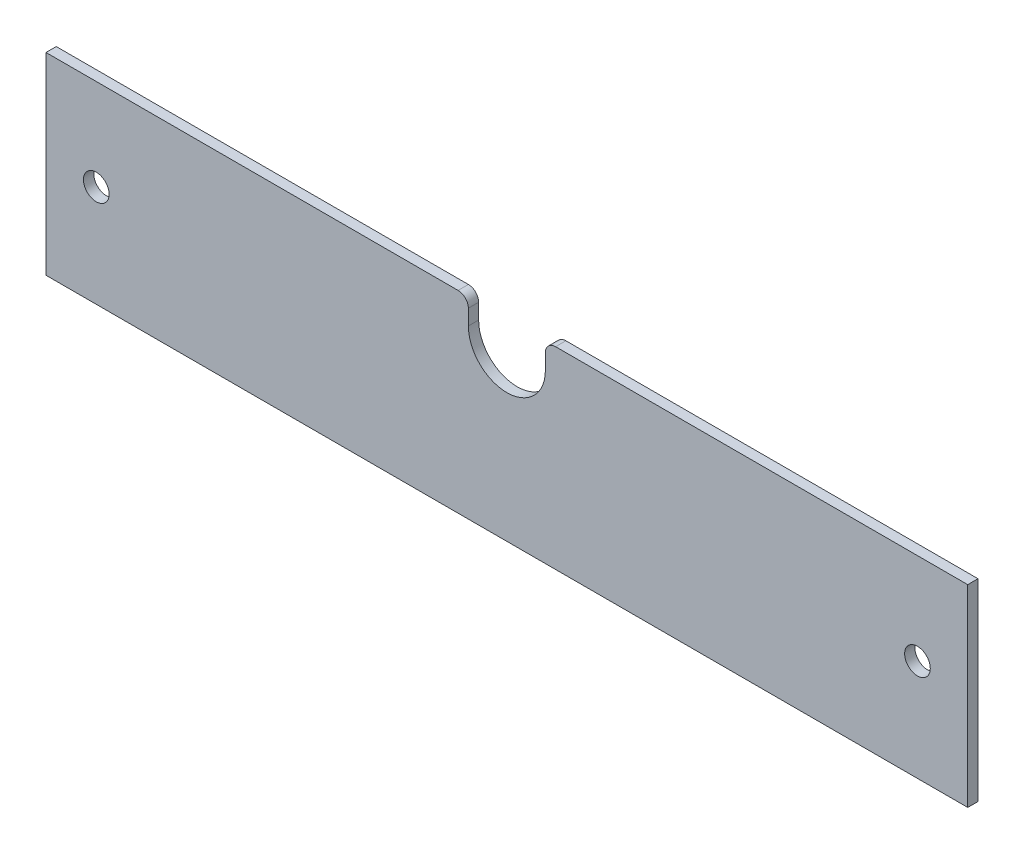
ISO-10303-21;
HEADER;
FILE_DESCRIPTION(('STEP AP214'),'2;1');
FILE_NAME('part.step','',(''),(''),'','','');
FILE_SCHEMA(('AUTOMOTIVE_DESIGN { 1 0 10303 214 1 1 1 1 }'));
ENDSEC;
DATA;
#1=APPLICATION_CONTEXT('core data for automotive mechanical design processes');
#2=APPLICATION_PROTOCOL_DEFINITION('international standard','automotive_design',2000,#1);
#3=PRODUCT_CONTEXT('',#1,'mechanical');
#4=PRODUCT('Part','Part','',(#3));
#5=PRODUCT_RELATED_PRODUCT_CATEGORY('part','',(#4));
#6=PRODUCT_DEFINITION_FORMATION('','',#4);
#7=PRODUCT_DEFINITION_CONTEXT('part definition',#1,'design');
#8=PRODUCT_DEFINITION('design','',#6,#7);
#9=PRODUCT_DEFINITION_SHAPE('','',#8);
#10=(LENGTH_UNIT() NAMED_UNIT(*) SI_UNIT(.MILLI.,.METRE.));
#11=(NAMED_UNIT(*) PLANE_ANGLE_UNIT() SI_UNIT($,.RADIAN.));
#12=(NAMED_UNIT(*) SI_UNIT($,.STERADIAN.) SOLID_ANGLE_UNIT());
#13=UNCERTAINTY_MEASURE_WITH_UNIT(LENGTH_MEASURE(1.E-05),#10,'distance_accuracy_value','');
#14=(GEOMETRIC_REPRESENTATION_CONTEXT(3) GLOBAL_UNCERTAINTY_ASSIGNED_CONTEXT((#13)) GLOBAL_UNIT_ASSIGNED_CONTEXT((#10,
#11,#12)) REPRESENTATION_CONTEXT('',''));
#15=CARTESIAN_POINT('',(0.,0.,0.));
#16=DIRECTION('',(0.,0.,1.));
#17=DIRECTION('',(1.,0.,0.));
#18=AXIS2_PLACEMENT_3D('',#15,#16,#17);
#19=CARTESIAN_POINT('',(0.,13.8,2.));
#20=DIRECTION('',(0.,0.,-1.));
#21=DIRECTION('',(-1.,0.,0.));
#22=AXIS2_PLACEMENT_3D('',#19,#20,#21);
#23=CYLINDRICAL_SURFACE('',#22,7.5);
#24=CARTESIAN_POINT('',(0.,13.8,0.));
#25=DIRECTION('',(0.,0.,1.));
#26=DIRECTION('',(1.,0.,0.));
#27=AXIS2_PLACEMENT_3D('',#24,#25,#26);
#28=CIRCLE('',#27,7.5);
#29=CARTESIAN_POINT('',(-7.5,13.8,0.));
#30=VERTEX_POINT('',#29);
#31=CARTESIAN_POINT('',(7.5,13.8,0.));
#32=VERTEX_POINT('',#31);
#33=EDGE_CURVE('E134',#30,#32,#28,.T.);
#34=ORIENTED_EDGE('',*,*,#33,.F.);
#35=DIRECTION('',(0.,0.,-1.));
#36=VECTOR('',#35,1.);
#37=CARTESIAN_POINT('',(-7.5,13.8,2.));
#38=LINE('',#37,#36);
#39=CARTESIAN_POINT('',(-7.5,13.8,2.));
#40=VERTEX_POINT('',#39);
#41=EDGE_CURVE('E121',#40,#30,#38,.T.);
#42=ORIENTED_EDGE('',*,*,#41,.F.);
#43=CARTESIAN_POINT('',(0.,13.8,2.));
#44=DIRECTION('',(0.,0.,1.));
#45=DIRECTION('',(1.,0.,0.));
#46=AXIS2_PLACEMENT_3D('',#43,#44,#45);
#47=CIRCLE('',#46,7.5);
#48=CARTESIAN_POINT('',(7.5,13.8,2.));
#49=VERTEX_POINT('',#48);
#50=EDGE_CURVE('E128',#40,#49,#47,.T.);
#51=ORIENTED_EDGE('',*,*,#50,.T.);
#52=DIRECTION('',(0.,0.,-1.));
#53=VECTOR('',#52,1.);
#54=CARTESIAN_POINT('',(7.5,13.8,2.));
#55=LINE('',#54,#53);
#56=EDGE_CURVE('E166',#49,#32,#55,.T.);
#57=ORIENTED_EDGE('',*,*,#56,.T.);
#58=EDGE_LOOP('',(#34,#42,#51,#57));
#59=FACE_BOUND('',#58,.T.);
#60=ADVANCED_FACE('F41',(#59),#23,.F.);
#61=CARTESIAN_POINT('',(-7.50000000000001,0.,2.));
#62=DIRECTION('',(1.,0.,0.));
#63=DIRECTION('',(0.,1.,0.));
#64=AXIS2_PLACEMENT_3D('',#61,#62,#63);
#65=PLANE('',#64);
#66=DIRECTION('',(0.,-1.,0.));
#67=VECTOR('',#66,1.);
#68=CARTESIAN_POINT('',(-7.50000000000001,0.,0.));
#69=LINE('',#68,#67);
#70=CARTESIAN_POINT('',(-7.5,16.8,0.));
#71=VERTEX_POINT('',#70);
#72=EDGE_CURVE('E168',#71,#30,#69,.T.);
#73=ORIENTED_EDGE('',*,*,#72,.F.);
#74=DIRECTION('',(0.,0.,-1.));
#75=VECTOR('',#74,1.);
#76=CARTESIAN_POINT('',(-7.5,16.8,2.));
#77=LINE('',#76,#75);
#78=CARTESIAN_POINT('',(-7.5,16.8,2.));
#79=VERTEX_POINT('',#78);
#80=EDGE_CURVE('E124',#71,#79,#77,.F.);
#81=ORIENTED_EDGE('',*,*,#80,.T.);
#82=DIRECTION('',(0.,-1.,0.));
#83=VECTOR('',#82,1.);
#84=CARTESIAN_POINT('',(-7.50000000000001,0.,2.));
#85=LINE('',#84,#83);
#86=EDGE_CURVE('E117',#79,#40,#85,.T.);
#87=ORIENTED_EDGE('',*,*,#86,.T.);
#88=ORIENTED_EDGE('',*,*,#41,.T.);
#89=EDGE_LOOP('',(#73,#81,#87,#88));
#90=FACE_BOUND('',#89,.T.);
#91=ADVANCED_FACE('F120',(#90),#65,.T.);
#92=CARTESIAN_POINT('',(0.,18.8,2.));
#93=DIRECTION('',(0.,1.,0.));
#94=DIRECTION('',(0.,0.,1.));
#95=AXIS2_PLACEMENT_3D('',#92,#93,#94);
#96=PLANE('',#95);
#97=DIRECTION('',(1.,0.,0.));
#98=VECTOR('',#97,1.);
#99=CARTESIAN_POINT('',(0.,18.8,2.));
#100=LINE('',#99,#98);
#101=CARTESIAN_POINT('',(-89.8,18.8,2.));
#102=VERTEX_POINT('',#101);
#103=CARTESIAN_POINT('',(-9.5,18.8,2.));
#104=VERTEX_POINT('',#103);
#105=EDGE_CURVE('E127',#102,#104,#100,.T.);
#106=ORIENTED_EDGE('',*,*,#105,.T.);
#107=DIRECTION('',(0.,0.,-1.));
#108=VECTOR('',#107,1.);
#109=CARTESIAN_POINT('',(-9.5,18.8,2.));
#110=LINE('',#109,#108);
#111=CARTESIAN_POINT('',(-9.5,18.8,0.));
#112=VERTEX_POINT('',#111);
#113=EDGE_CURVE('E135',#104,#112,#110,.T.);
#114=ORIENTED_EDGE('',*,*,#113,.T.);
#115=DIRECTION('',(1.,0.,0.));
#116=VECTOR('',#115,1.);
#117=CARTESIAN_POINT('',(0.,18.8,0.));
#118=LINE('',#117,#116);
#119=CARTESIAN_POINT('',(-89.8,18.8,0.));
#120=VERTEX_POINT('',#119);
#121=EDGE_CURVE('E170',#120,#112,#118,.T.);
#122=ORIENTED_EDGE('',*,*,#121,.F.);
#123=DIRECTION('',(0.,0.,-1.));
#124=VECTOR('',#123,1.);
#125=CARTESIAN_POINT('',(-89.8,18.8,2.));
#126=LINE('',#125,#124);
#127=EDGE_CURVE('E136',#102,#120,#126,.T.);
#128=ORIENTED_EDGE('',*,*,#127,.F.);
#129=EDGE_LOOP('',(#106,#114,#122,#128));
#130=FACE_BOUND('',#129,.T.);
#131=ADVANCED_FACE('F220',(#130),#96,.T.);
#132=CARTESIAN_POINT('',(-89.8,0.,2.));
#133=DIRECTION('',(-1.,0.,0.));
#134=DIRECTION('',(0.,0.,1.));
#135=AXIS2_PLACEMENT_3D('',#132,#133,#134);
#136=PLANE('',#135);
#137=DIRECTION('',(0.,1.,0.));
#138=VECTOR('',#137,1.);
#139=CARTESIAN_POINT('',(-89.8,0.,0.));
#140=LINE('',#139,#138);
#141=CARTESIAN_POINT('',(-89.8,-18.8,0.));
#142=VERTEX_POINT('',#141);
#143=EDGE_CURVE('E173',#142,#120,#140,.T.);
#144=ORIENTED_EDGE('',*,*,#143,.F.);
#145=DIRECTION('',(0.,0.,-1.));
#146=VECTOR('',#145,1.);
#147=CARTESIAN_POINT('',(-89.8,-18.8,2.));
#148=LINE('',#147,#146);
#149=CARTESIAN_POINT('',(-89.8,-18.8,2.));
#150=VERTEX_POINT('',#149);
#151=EDGE_CURVE('E193',#150,#142,#148,.T.);
#152=ORIENTED_EDGE('',*,*,#151,.F.);
#153=DIRECTION('',(0.,1.,0.));
#154=VECTOR('',#153,1.);
#155=CARTESIAN_POINT('',(-89.8,0.,2.));
#156=LINE('',#155,#154);
#157=EDGE_CURVE('E150',#150,#102,#156,.T.);
#158=ORIENTED_EDGE('',*,*,#157,.T.);
#159=ORIENTED_EDGE('',*,*,#127,.T.);
#160=EDGE_LOOP('',(#144,#152,#158,#159));
#161=FACE_BOUND('',#160,.T.);
#162=ADVANCED_FACE('F224',(#161),#136,.T.);
#163=CARTESIAN_POINT('',(0.,-18.8,2.));
#164=DIRECTION('',(0.,1.,0.));
#165=DIRECTION('',(0.,0.,1.));
#166=AXIS2_PLACEMENT_3D('',#163,#164,#165);
#167=PLANE('',#166);
#168=DIRECTION('',(1.,0.,0.));
#169=VECTOR('',#168,1.);
#170=CARTESIAN_POINT('',(0.,-18.8,0.));
#171=LINE('',#170,#169);
#172=CARTESIAN_POINT('',(89.8,-18.8,0.));
#173=VERTEX_POINT('',#172);
#174=EDGE_CURVE('E177',#142,#173,#171,.T.);
#175=ORIENTED_EDGE('',*,*,#174,.T.);
#176=DIRECTION('',(0.,0.,-1.));
#177=VECTOR('',#176,1.);
#178=CARTESIAN_POINT('',(89.8,-18.8,2.));
#179=LINE('',#178,#177);
#180=CARTESIAN_POINT('',(89.8,-18.8,2.));
#181=VERTEX_POINT('',#180);
#182=EDGE_CURVE('E190',#181,#173,#179,.T.);
#183=ORIENTED_EDGE('',*,*,#182,.F.);
#184=DIRECTION('',(1.,0.,0.));
#185=VECTOR('',#184,1.);
#186=CARTESIAN_POINT('',(0.,-18.8,2.));
#187=LINE('',#186,#185);
#188=EDGE_CURVE('E154',#150,#181,#187,.T.);
#189=ORIENTED_EDGE('',*,*,#188,.F.);
#190=ORIENTED_EDGE('',*,*,#151,.T.);
#191=EDGE_LOOP('',(#175,#183,#189,#190));
#192=FACE_BOUND('',#191,.T.);
#193=ADVANCED_FACE('F230',(#192),#167,.F.);
#194=CARTESIAN_POINT('',(89.8,0.,2.));
#195=DIRECTION('',(-1.,0.,0.));
#196=DIRECTION('',(0.,0.,1.));
#197=AXIS2_PLACEMENT_3D('',#194,#195,#196);
#198=PLANE('',#197);
#199=DIRECTION('',(0.,1.,0.));
#200=VECTOR('',#199,1.);
#201=CARTESIAN_POINT('',(89.8,0.,0.));
#202=LINE('',#201,#200);
#203=CARTESIAN_POINT('',(89.8,18.8,0.));
#204=VERTEX_POINT('',#203);
#205=EDGE_CURVE('E179',#173,#204,#202,.T.);
#206=ORIENTED_EDGE('',*,*,#205,.T.);
#207=DIRECTION('',(0.,0.,-1.));
#208=VECTOR('',#207,1.);
#209=CARTESIAN_POINT('',(89.8,18.8,2.));
#210=LINE('',#209,#208);
#211=CARTESIAN_POINT('',(89.8,18.8,2.));
#212=VERTEX_POINT('',#211);
#213=EDGE_CURVE('E187',#212,#204,#210,.T.);
#214=ORIENTED_EDGE('',*,*,#213,.F.);
#215=DIRECTION('',(0.,1.,0.));
#216=VECTOR('',#215,1.);
#217=CARTESIAN_POINT('',(89.8,0.,2.));
#218=LINE('',#217,#216);
#219=EDGE_CURVE('E156',#181,#212,#218,.T.);
#220=ORIENTED_EDGE('',*,*,#219,.F.);
#221=ORIENTED_EDGE('',*,*,#182,.T.);
#222=EDGE_LOOP('',(#206,#214,#220,#221));
#223=FACE_BOUND('',#222,.T.);
#224=ADVANCED_FACE('F234',(#223),#198,.F.);
#225=CARTESIAN_POINT('',(9.5,18.8,0.));
#226=VERTEX_POINT('',#225);
#227=EDGE_CURVE('E174',#226,#204,#118,.T.);
#228=ORIENTED_EDGE('',*,*,#227,.F.);
#229=DIRECTION('',(0.,0.,-1.));
#230=VECTOR('',#229,1.);
#231=CARTESIAN_POINT('',(9.5,18.8,2.));
#232=LINE('',#231,#230);
#233=CARTESIAN_POINT('',(9.5,18.8,2.));
#234=VERTEX_POINT('',#233);
#235=EDGE_CURVE('E11',#226,#234,#232,.F.);
#236=ORIENTED_EDGE('',*,*,#235,.T.);
#237=EDGE_CURVE('E151',#234,#212,#100,.T.);
#238=ORIENTED_EDGE('',*,*,#237,.T.);
#239=ORIENTED_EDGE('',*,*,#213,.T.);
#240=EDGE_LOOP('',(#228,#236,#238,#239));
#241=FACE_BOUND('',#240,.T.);
#242=ADVANCED_FACE('F235',(#241),#96,.T.);
#243=CARTESIAN_POINT('',(80.,1.,2.));
#244=DIRECTION('',(0.,0.,-1.));
#245=DIRECTION('',(-1.,0.,0.));
#246=AXIS2_PLACEMENT_3D('',#243,#244,#245);
#247=CYLINDRICAL_SURFACE('',#246,2.50000000000001);
#248=CARTESIAN_POINT('',(80.,1.,2.));
#249=DIRECTION('',(0.,0.,1.));
#250=DIRECTION('',(1.,0.,0.));
#251=AXIS2_PLACEMENT_3D('',#248,#249,#250);
#252=CIRCLE('',#251,2.50000000000001);
#253=CARTESIAN_POINT('',(82.5,1.,2.));
#254=VERTEX_POINT('',#253);
#255=EDGE_CURVE('E160',#254,#254,#252,.F.);
#256=ORIENTED_EDGE('',*,*,#255,.F.);
#257=EDGE_LOOP('',(#256));
#258=FACE_BOUND('',#257,.T.);
#259=CARTESIAN_POINT('',(80.,1.,0.));
#260=DIRECTION('',(0.,0.,1.));
#261=DIRECTION('',(1.,0.,0.));
#262=AXIS2_PLACEMENT_3D('',#259,#260,#261);
#263=CIRCLE('',#262,2.50000000000001);
#264=CARTESIAN_POINT('',(82.5,1.,0.));
#265=VERTEX_POINT('',#264);
#266=EDGE_CURVE('E145',#265,#265,#263,.F.);
#267=ORIENTED_EDGE('',*,*,#266,.T.);
#268=EDGE_LOOP('',(#267));
#269=FACE_BOUND('',#268,.T.);
#270=ADVANCED_FACE('F255',(#258,#269),#247,.F.);
#271=CARTESIAN_POINT('',(7.50000000000001,0.,2.));
#272=DIRECTION('',(1.,0.,0.));
#273=DIRECTION('',(0.,1.,0.));
#274=AXIS2_PLACEMENT_3D('',#271,#272,#273);
#275=PLANE('',#274);
#276=DIRECTION('',(0.,-1.,0.));
#277=VECTOR('',#276,1.);
#278=CARTESIAN_POINT('',(7.50000000000001,0.,2.));
#279=LINE('',#278,#277);
#280=CARTESIAN_POINT('',(7.5,16.8,2.));
#281=VERTEX_POINT('',#280);
#282=EDGE_CURVE('E140',#281,#49,#279,.T.);
#283=ORIENTED_EDGE('',*,*,#282,.F.);
#284=DIRECTION('',(0.,0.,-1.));
#285=VECTOR('',#284,1.);
#286=CARTESIAN_POINT('',(7.5,16.8,0.));
#287=LINE('',#286,#285);
#288=CARTESIAN_POINT('',(7.5,16.8,0.));
#289=VERTEX_POINT('',#288);
#290=EDGE_CURVE('E49',#281,#289,#287,.T.);
#291=ORIENTED_EDGE('',*,*,#290,.T.);
#292=DIRECTION('',(0.,-1.,0.));
#293=VECTOR('',#292,1.);
#294=CARTESIAN_POINT('',(7.50000000000001,0.,0.));
#295=LINE('',#294,#293);
#296=EDGE_CURVE('E182',#289,#32,#295,.T.);
#297=ORIENTED_EDGE('',*,*,#296,.T.);
#298=ORIENTED_EDGE('',*,*,#56,.F.);
#299=EDGE_LOOP('',(#283,#291,#297,#298));
#300=FACE_BOUND('',#299,.T.);
#301=ADVANCED_FACE('F209',(#300),#275,.F.);
#302=CARTESIAN_POINT('',(-80.,1.,2.));
#303=DIRECTION('',(0.,0.,-1.));
#304=DIRECTION('',(-1.,0.,0.));
#305=AXIS2_PLACEMENT_3D('',#302,#303,#304);
#306=CYLINDRICAL_SURFACE('',#305,2.50000000000001);
#307=CARTESIAN_POINT('',(-80.,1.,2.));
#308=DIRECTION('',(0.,0.,1.));
#309=DIRECTION('',(1.,0.,0.));
#310=AXIS2_PLACEMENT_3D('',#307,#308,#309);
#311=CIRCLE('',#310,2.50000000000001);
#312=CARTESIAN_POINT('',(-77.5,1.,2.));
#313=VERTEX_POINT('',#312);
#314=EDGE_CURVE('E163',#313,#313,#311,.T.);
#315=ORIENTED_EDGE('',*,*,#314,.T.);
#316=EDGE_LOOP('',(#315));
#317=FACE_BOUND('',#316,.T.);
#318=CARTESIAN_POINT('',(-80.,1.,0.));
#319=DIRECTION('',(0.,0.,1.));
#320=DIRECTION('',(1.,0.,0.));
#321=AXIS2_PLACEMENT_3D('',#318,#319,#320);
#322=CIRCLE('',#321,2.50000000000001);
#323=CARTESIAN_POINT('',(-77.5,1.,0.));
#324=VERTEX_POINT('',#323);
#325=EDGE_CURVE('E142',#324,#324,#322,.T.);
#326=ORIENTED_EDGE('',*,*,#325,.F.);
#327=EDGE_LOOP('',(#326));
#328=FACE_BOUND('',#327,.T.);
#329=ADVANCED_FACE('F258',(#317,#328),#306,.F.);
#330=CARTESIAN_POINT('',(0.,0.,2.));
#331=DIRECTION('',(0.,0.,1.));
#332=DIRECTION('',(1.,0.,0.));
#333=AXIS2_PLACEMENT_3D('',#330,#331,#332);
#334=PLANE('',#333);
#335=ORIENTED_EDGE('',*,*,#86,.F.);
#336=CARTESIAN_POINT('',(-9.5,16.8,2.));
#337=DIRECTION('',(0.,0.,1.));
#338=DIRECTION('',(1.,0.,0.));
#339=AXIS2_PLACEMENT_3D('',#336,#337,#338);
#340=CIRCLE('',#339,2.);
#341=EDGE_CURVE('E204',#79,#104,#340,.T.);
#342=ORIENTED_EDGE('',*,*,#341,.T.);
#343=ORIENTED_EDGE('',*,*,#105,.F.);
#344=ORIENTED_EDGE('',*,*,#157,.F.);
#345=ORIENTED_EDGE('',*,*,#188,.T.);
#346=ORIENTED_EDGE('',*,*,#219,.T.);
#347=ORIENTED_EDGE('',*,*,#237,.F.);
#348=CARTESIAN_POINT('',(9.5,16.8,2.));
#349=DIRECTION('',(0.,0.,1.));
#350=DIRECTION('',(1.,0.,0.));
#351=AXIS2_PLACEMENT_3D('',#348,#349,#350);
#352=CIRCLE('',#351,2.);
#353=EDGE_CURVE('E56',#234,#281,#352,.T.);
#354=ORIENTED_EDGE('',*,*,#353,.T.);
#355=ORIENTED_EDGE('',*,*,#282,.T.);
#356=ORIENTED_EDGE('',*,*,#50,.F.);
#357=EDGE_LOOP('',(#335,#342,#343,#344,#345,#346,#347,#354,#355,#356));
#358=FACE_BOUND('',#357,.T.);
#359=ORIENTED_EDGE('',*,*,#255,.T.);
#360=EDGE_LOOP('',(#359));
#361=FACE_BOUND('',#360,.T.);
#362=ORIENTED_EDGE('',*,*,#314,.F.);
#363=EDGE_LOOP('',(#362));
#364=FACE_BOUND('',#363,.T.);
#365=ADVANCED_FACE('F138',(#358,#361,#364),#334,.T.);
#366=CARTESIAN_POINT('',(0.,0.,0.));
#367=DIRECTION('',(0.,0.,1.));
#368=DIRECTION('',(1.,0.,0.));
#369=AXIS2_PLACEMENT_3D('',#366,#367,#368);
#370=PLANE('',#369);
#371=ORIENTED_EDGE('',*,*,#121,.T.);
#372=CARTESIAN_POINT('',(-9.5,16.8,0.));
#373=DIRECTION('',(0.,0.,1.));
#374=DIRECTION('',(1.,0.,0.));
#375=AXIS2_PLACEMENT_3D('',#372,#373,#374);
#376=CIRCLE('',#375,2.);
#377=EDGE_CURVE('E200',#112,#71,#376,.F.);
#378=ORIENTED_EDGE('',*,*,#377,.T.);
#379=ORIENTED_EDGE('',*,*,#72,.T.);
#380=ORIENTED_EDGE('',*,*,#33,.T.);
#381=ORIENTED_EDGE('',*,*,#296,.F.);
#382=CARTESIAN_POINT('',(9.5,16.8,0.));
#383=DIRECTION('',(0.,0.,1.));
#384=DIRECTION('',(1.,0.,0.));
#385=AXIS2_PLACEMENT_3D('',#382,#383,#384);
#386=CIRCLE('',#385,2.);
#387=EDGE_CURVE('E198',#289,#226,#386,.F.);
#388=ORIENTED_EDGE('',*,*,#387,.T.);
#389=ORIENTED_EDGE('',*,*,#227,.T.);
#390=ORIENTED_EDGE('',*,*,#205,.F.);
#391=ORIENTED_EDGE('',*,*,#174,.F.);
#392=ORIENTED_EDGE('',*,*,#143,.T.);
#393=EDGE_LOOP('',(#371,#378,#379,#380,#381,#388,#389,#390,#391,#392));
#394=FACE_BOUND('',#393,.T.);
#395=ORIENTED_EDGE('',*,*,#266,.F.);
#396=EDGE_LOOP('',(#395));
#397=FACE_BOUND('',#396,.T.);
#398=ORIENTED_EDGE('',*,*,#325,.T.);
#399=EDGE_LOOP('',(#398));
#400=FACE_BOUND('',#399,.T.);
#401=ADVANCED_FACE('F212',(#394,#397,#400),#370,.F.);
#402=CARTESIAN_POINT('',(-9.5,16.8,2.));
#403=DIRECTION('',(0.,0.,-1.));
#404=DIRECTION('',(-1.,0.,0.));
#405=AXIS2_PLACEMENT_3D('',#402,#403,#404);
#406=CYLINDRICAL_SURFACE('',#405,2.);
#407=ORIENTED_EDGE('',*,*,#341,.F.);
#408=ORIENTED_EDGE('',*,*,#80,.F.);
#409=ORIENTED_EDGE('',*,*,#377,.F.);
#410=ORIENTED_EDGE('',*,*,#113,.F.);
#411=EDGE_LOOP('',(#407,#408,#409,#410));
#412=FACE_BOUND('',#411,.T.);
#413=ADVANCED_FACE('F215',(#412),#406,.T.);
#414=CARTESIAN_POINT('',(9.5,16.8,2.));
#415=DIRECTION('',(0.,0.,1.));
#416=DIRECTION('',(1.,0.,0.));
#417=AXIS2_PLACEMENT_3D('',#414,#415,#416);
#418=CYLINDRICAL_SURFACE('',#417,2.);
#419=ORIENTED_EDGE('',*,*,#353,.F.);
#420=ORIENTED_EDGE('',*,*,#235,.F.);
#421=ORIENTED_EDGE('',*,*,#387,.F.);
#422=ORIENTED_EDGE('',*,*,#290,.F.);
#423=EDGE_LOOP('',(#419,#420,#421,#422));
#424=FACE_BOUND('',#423,.T.);
#425=ADVANCED_FACE('F43',(#424),#418,.T.);
#426=CLOSED_SHELL('',(#60,#91,#131,#162,#193,#224,#242,#270,#301,#329,#365,#401,#413,#425));
#427=MANIFOLD_SOLID_BREP('B2',#426);
#428=ADVANCED_BREP_SHAPE_REPRESENTATION('',(#18,#427),#14);
#429=SHAPE_DEFINITION_REPRESENTATION(#9,#428);
ENDSEC;
END-ISO-10303-21;
